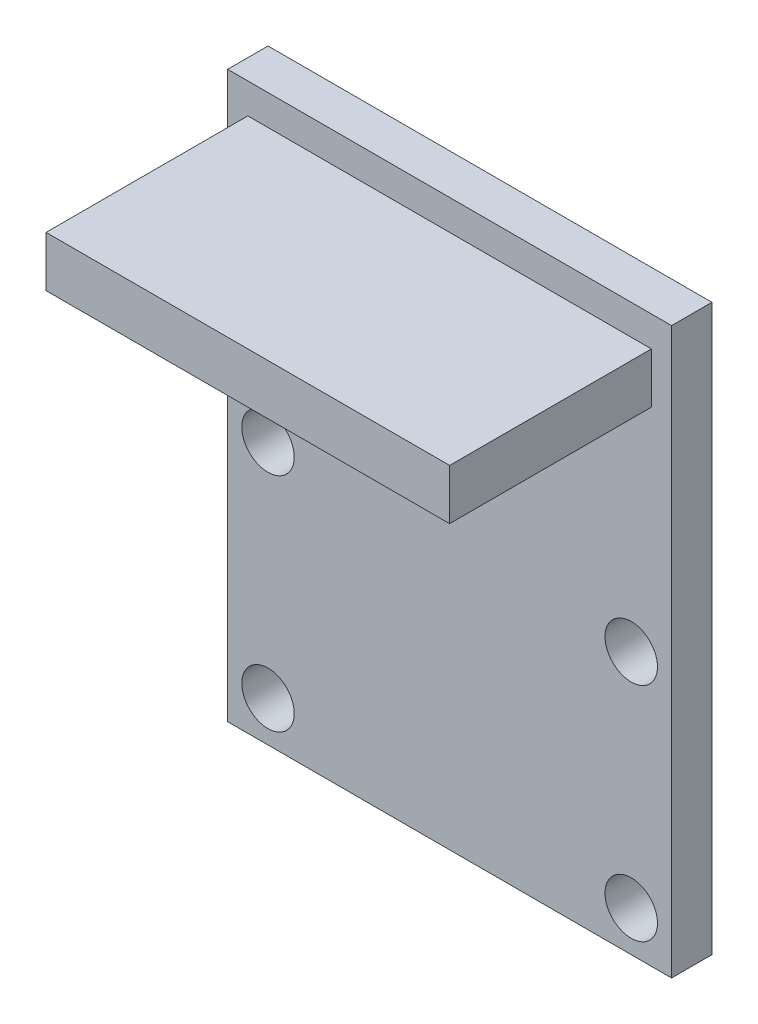
ISO-10303-21;
HEADER;
FILE_DESCRIPTION(('STEP AP214'),'2;1');
FILE_NAME('part.step','',(''),(''),'','','');
FILE_SCHEMA(('AUTOMOTIVE_DESIGN { 1 0 10303 214 1 1 1 1 }'));
ENDSEC;
DATA;
#1=APPLICATION_CONTEXT('core data for automotive mechanical design processes');
#2=APPLICATION_PROTOCOL_DEFINITION('international standard','automotive_design',2000,#1);
#3=PRODUCT_CONTEXT('',#1,'mechanical');
#4=PRODUCT('Part','Part','',(#3));
#5=PRODUCT_RELATED_PRODUCT_CATEGORY('part','',(#4));
#6=PRODUCT_DEFINITION_FORMATION('','',#4);
#7=PRODUCT_DEFINITION_CONTEXT('part definition',#1,'design');
#8=PRODUCT_DEFINITION('design','',#6,#7);
#9=PRODUCT_DEFINITION_SHAPE('','',#8);
#10=(LENGTH_UNIT() NAMED_UNIT(*) SI_UNIT(.MILLI.,.METRE.));
#11=(NAMED_UNIT(*) PLANE_ANGLE_UNIT() SI_UNIT($,.RADIAN.));
#12=(NAMED_UNIT(*) SI_UNIT($,.STERADIAN.) SOLID_ANGLE_UNIT());
#13=UNCERTAINTY_MEASURE_WITH_UNIT(LENGTH_MEASURE(1.E-05),#10,'distance_accuracy_value','');
#14=(GEOMETRIC_REPRESENTATION_CONTEXT(3) GLOBAL_UNCERTAINTY_ASSIGNED_CONTEXT((#13)) GLOBAL_UNIT_ASSIGNED_CONTEXT((#10,
#11,#12)) REPRESENTATION_CONTEXT('',''));
#15=CARTESIAN_POINT('',(0.,0.,0.));
#16=DIRECTION('',(0.,0.,1.));
#17=DIRECTION('',(1.,0.,0.));
#18=AXIS2_PLACEMENT_3D('',#15,#16,#17);
#19=CARTESIAN_POINT('',(0.,0.,2.));
#20=DIRECTION('',(0.,0.,1.));
#21=DIRECTION('',(1.,0.,0.));
#22=AXIS2_PLACEMENT_3D('',#19,#20,#21);
#23=PLANE('',#22);
#24=CARTESIAN_POINT('',(-9.,-0.99794599362229,2.));
#25=DIRECTION('',(0.,0.,1.));
#26=DIRECTION('',(1.,0.,0.));
#27=AXIS2_PLACEMENT_3D('',#24,#25,#26);
#28=CIRCLE('',#27,1.3);
#29=CARTESIAN_POINT('',(-7.7,-0.99794599362229,2.));
#30=VERTEX_POINT('',#29);
#31=EDGE_CURVE('E148',#30,#30,#28,.T.);
#32=ORIENTED_EDGE('',*,*,#31,.F.);
#33=EDGE_LOOP('',(#32));
#34=FACE_BOUND('',#33,.T.);
#35=CARTESIAN_POINT('',(-9.,-11.9979459936223,2.));
#36=DIRECTION('',(0.,0.,1.));
#37=DIRECTION('',(1.,0.,0.));
#38=AXIS2_PLACEMENT_3D('',#35,#36,#37);
#39=CIRCLE('',#38,1.3);
#40=CARTESIAN_POINT('',(-7.7,-11.9979459936223,2.));
#41=VERTEX_POINT('',#40);
#42=EDGE_CURVE('E160',#41,#41,#39,.T.);
#43=ORIENTED_EDGE('',*,*,#42,.F.);
#44=EDGE_LOOP('',(#43));
#45=FACE_BOUND('',#44,.T.);
#46=DIRECTION('',(0.,-1.,0.));
#47=VECTOR('',#46,1.);
#48=CARTESIAN_POINT('',(-11.,14.,2.));
#49=LINE('',#48,#47);
#50=CARTESIAN_POINT('',(-11.,14.,2.));
#51=VERTEX_POINT('',#50);
#52=CARTESIAN_POINT('',(-11.,-14.,2.));
#53=VERTEX_POINT('',#52);
#54=EDGE_CURVE('E166',#51,#53,#49,.T.);
#55=ORIENTED_EDGE('',*,*,#54,.T.);
#56=DIRECTION('',(1.,0.,0.));
#57=VECTOR('',#56,1.);
#58=CARTESIAN_POINT('',(-11.,-14.,2.));
#59=LINE('',#58,#57);
#60=CARTESIAN_POINT('',(11.,-14.,2.));
#61=VERTEX_POINT('',#60);
#62=EDGE_CURVE('E90',#53,#61,#59,.T.);
#63=ORIENTED_EDGE('',*,*,#62,.T.);
#64=DIRECTION('',(0.,1.,0.));
#65=VECTOR('',#64,1.);
#66=CARTESIAN_POINT('',(11.,14.,2.));
#67=LINE('',#66,#65);
#68=CARTESIAN_POINT('',(11.,14.,2.));
#69=VERTEX_POINT('',#68);
#70=EDGE_CURVE('E169',#61,#69,#67,.T.);
#71=ORIENTED_EDGE('',*,*,#70,.T.);
#72=DIRECTION('',(-1.,0.,0.));
#73=VECTOR('',#72,1.);
#74=CARTESIAN_POINT('',(-11.,14.,2.));
#75=LINE('',#74,#73);
#76=EDGE_CURVE('E62',#69,#51,#75,.T.);
#77=ORIENTED_EDGE('',*,*,#76,.T.);
#78=EDGE_LOOP('',(#55,#63,#71,#77));
#79=FACE_BOUND('',#78,.T.);
#80=CARTESIAN_POINT('',(9.,-0.997945993622284,2.));
#81=DIRECTION('',(0.,0.,1.));
#82=DIRECTION('',(1.,0.,0.));
#83=AXIS2_PLACEMENT_3D('',#80,#81,#82);
#84=CIRCLE('',#83,1.3);
#85=CARTESIAN_POINT('',(10.3,-0.997945993622284,2.));
#86=VERTEX_POINT('',#85);
#87=EDGE_CURVE('E154',#86,#86,#84,.T.);
#88=ORIENTED_EDGE('',*,*,#87,.F.);
#89=EDGE_LOOP('',(#88));
#90=FACE_BOUND('',#89,.T.);
#91=CARTESIAN_POINT('',(9.,-11.9979459936223,2.));
#92=DIRECTION('',(0.,0.,1.));
#93=DIRECTION('',(1.,0.,0.));
#94=AXIS2_PLACEMENT_3D('',#91,#92,#93);
#95=CIRCLE('',#94,1.3);
#96=CARTESIAN_POINT('',(10.3,-11.9979459936223,2.));
#97=VERTEX_POINT('',#96);
#98=EDGE_CURVE('E140',#97,#97,#95,.T.);
#99=ORIENTED_EDGE('',*,*,#98,.F.);
#100=EDGE_LOOP('',(#99));
#101=FACE_BOUND('',#100,.T.);
#102=DIRECTION('',(1.,0.,0.));
#103=VECTOR('',#102,1.);
#104=CARTESIAN_POINT('',(-10.,10.,2.));
#105=LINE('',#104,#103);
#106=CARTESIAN_POINT('',(-10.,10.,2.));
#107=VERTEX_POINT('',#106);
#108=CARTESIAN_POINT('',(9.99999999999999,10.,2.));
#109=VERTEX_POINT('',#108);
#110=EDGE_CURVE('E336',#107,#109,#105,.T.);
#111=ORIENTED_EDGE('',*,*,#110,.F.);
#112=DIRECTION('',(0.,-1.,0.));
#113=VECTOR('',#112,1.);
#114=CARTESIAN_POINT('',(-10.,10.,2.));
#115=LINE('',#114,#113);
#116=CARTESIAN_POINT('',(-10.,12.5,2.));
#117=VERTEX_POINT('',#116);
#118=EDGE_CURVE('E135',#117,#107,#115,.T.);
#119=ORIENTED_EDGE('',*,*,#118,.F.);
#120=DIRECTION('',(-1.,0.,0.));
#121=VECTOR('',#120,1.);
#122=CARTESIAN_POINT('',(-10.,12.5,2.));
#123=LINE('',#122,#121);
#124=CARTESIAN_POINT('',(9.99999999999999,12.5,2.));
#125=VERTEX_POINT('',#124);
#126=EDGE_CURVE('E131',#125,#117,#123,.T.);
#127=ORIENTED_EDGE('',*,*,#126,.F.);
#128=DIRECTION('',(0.,1.,0.));
#129=VECTOR('',#128,1.);
#130=CARTESIAN_POINT('',(9.99999999999999,10.,2.));
#131=LINE('',#130,#129);
#132=EDGE_CURVE('E333',#109,#125,#131,.T.);
#133=ORIENTED_EDGE('',*,*,#132,.F.);
#134=EDGE_LOOP('',(#111,#119,#127,#133));
#135=FACE_BOUND('',#134,.T.);
#136=ADVANCED_FACE('F38',(#34,#45,#79,#90,#101,#135),#23,.T.);
#137=CARTESIAN_POINT('',(0.,0.,0.));
#138=DIRECTION('',(0.,0.,1.));
#139=DIRECTION('',(1.,0.,0.));
#140=AXIS2_PLACEMENT_3D('',#137,#138,#139);
#141=PLANE('',#140);
#142=DIRECTION('',(0.,-1.,0.));
#143=VECTOR('',#142,1.);
#144=CARTESIAN_POINT('',(-11.,14.,0.));
#145=LINE('',#144,#143);
#146=CARTESIAN_POINT('',(-11.,14.,0.));
#147=VERTEX_POINT('',#146);
#148=CARTESIAN_POINT('',(-11.,-14.,0.));
#149=VERTEX_POINT('',#148);
#150=EDGE_CURVE('E163',#147,#149,#145,.T.);
#151=ORIENTED_EDGE('',*,*,#150,.F.);
#152=DIRECTION('',(-1.,0.,0.));
#153=VECTOR('',#152,1.);
#154=CARTESIAN_POINT('',(-11.,14.,0.));
#155=LINE('',#154,#153);
#156=CARTESIAN_POINT('',(11.,14.,0.));
#157=VERTEX_POINT('',#156);
#158=EDGE_CURVE('E83',#157,#147,#155,.T.);
#159=ORIENTED_EDGE('',*,*,#158,.F.);
#160=DIRECTION('',(0.,1.,0.));
#161=VECTOR('',#160,1.);
#162=CARTESIAN_POINT('',(11.,14.,0.));
#163=LINE('',#162,#161);
#164=CARTESIAN_POINT('',(11.,-14.,0.));
#165=VERTEX_POINT('',#164);
#166=EDGE_CURVE('E177',#165,#157,#163,.T.);
#167=ORIENTED_EDGE('',*,*,#166,.F.);
#168=DIRECTION('',(1.,0.,0.));
#169=VECTOR('',#168,1.);
#170=CARTESIAN_POINT('',(-11.,-14.,0.));
#171=LINE('',#170,#169);
#172=EDGE_CURVE('E175',#149,#165,#171,.T.);
#173=ORIENTED_EDGE('',*,*,#172,.F.);
#174=EDGE_LOOP('',(#151,#159,#167,#173));
#175=FACE_BOUND('',#174,.T.);
#176=CARTESIAN_POINT('',(-9.,-11.9979459936223,0.));
#177=DIRECTION('',(0.,0.,1.));
#178=DIRECTION('',(1.,0.,0.));
#179=AXIS2_PLACEMENT_3D('',#176,#177,#178);
#180=CIRCLE('',#179,1.3);
#181=CARTESIAN_POINT('',(-7.7,-11.9979459936223,0.));
#182=VERTEX_POINT('',#181);
#183=EDGE_CURVE('E157',#182,#182,#180,.T.);
#184=ORIENTED_EDGE('',*,*,#183,.T.);
#185=EDGE_LOOP('',(#184));
#186=FACE_BOUND('',#185,.T.);
#187=CARTESIAN_POINT('',(9.,-0.997945993622284,0.));
#188=DIRECTION('',(0.,0.,1.));
#189=DIRECTION('',(1.,0.,0.));
#190=AXIS2_PLACEMENT_3D('',#187,#188,#189);
#191=CIRCLE('',#190,1.3);
#192=CARTESIAN_POINT('',(10.3,-0.997945993622284,0.));
#193=VERTEX_POINT('',#192);
#194=EDGE_CURVE('E151',#193,#193,#191,.T.);
#195=ORIENTED_EDGE('',*,*,#194,.T.);
#196=EDGE_LOOP('',(#195));
#197=FACE_BOUND('',#196,.T.);
#198=CARTESIAN_POINT('',(-9.,-0.99794599362229,0.));
#199=DIRECTION('',(0.,0.,1.));
#200=DIRECTION('',(1.,0.,0.));
#201=AXIS2_PLACEMENT_3D('',#198,#199,#200);
#202=CIRCLE('',#201,1.3);
#203=CARTESIAN_POINT('',(-7.7,-0.99794599362229,0.));
#204=VERTEX_POINT('',#203);
#205=EDGE_CURVE('E146',#204,#204,#202,.T.);
#206=ORIENTED_EDGE('',*,*,#205,.T.);
#207=EDGE_LOOP('',(#206));
#208=FACE_BOUND('',#207,.T.);
#209=CARTESIAN_POINT('',(9.,-11.9979459936223,0.));
#210=DIRECTION('',(0.,0.,1.));
#211=DIRECTION('',(1.,0.,0.));
#212=AXIS2_PLACEMENT_3D('',#209,#210,#211);
#213=CIRCLE('',#212,1.3);
#214=CARTESIAN_POINT('',(10.3,-11.9979459936223,0.));
#215=VERTEX_POINT('',#214);
#216=EDGE_CURVE('E137',#215,#215,#213,.T.);
#217=ORIENTED_EDGE('',*,*,#216,.T.);
#218=EDGE_LOOP('',(#217));
#219=FACE_BOUND('',#218,.T.);
#220=ADVANCED_FACE('F190',(#175,#186,#197,#208,#219),#141,.F.);
#221=CARTESIAN_POINT('',(-11.,14.,2.));
#222=DIRECTION('',(1.,0.,0.));
#223=DIRECTION('',(0.,1.,0.));
#224=AXIS2_PLACEMENT_3D('',#221,#222,#223);
#225=PLANE('',#224);
#226=ORIENTED_EDGE('',*,*,#150,.T.);
#227=DIRECTION('',(0.,0.,-1.));
#228=VECTOR('',#227,1.);
#229=CARTESIAN_POINT('',(-11.,-14.,2.));
#230=LINE('',#229,#228);
#231=EDGE_CURVE('E11',#53,#149,#230,.T.);
#232=ORIENTED_EDGE('',*,*,#231,.F.);
#233=ORIENTED_EDGE('',*,*,#54,.F.);
#234=DIRECTION('',(0.,0.,-1.));
#235=VECTOR('',#234,1.);
#236=CARTESIAN_POINT('',(-11.,14.,2.));
#237=LINE('',#236,#235);
#238=EDGE_CURVE('E172',#51,#147,#237,.T.);
#239=ORIENTED_EDGE('',*,*,#238,.T.);
#240=EDGE_LOOP('',(#226,#232,#233,#239));
#241=FACE_BOUND('',#240,.T.);
#242=ADVANCED_FACE('F40',(#241),#225,.F.);
#243=CARTESIAN_POINT('',(-11.,-14.,2.));
#244=DIRECTION('',(0.,1.,0.));
#245=DIRECTION('',(-1.,0.,0.));
#246=AXIS2_PLACEMENT_3D('',#243,#244,#245);
#247=PLANE('',#246);
#248=ORIENTED_EDGE('',*,*,#172,.T.);
#249=DIRECTION('',(0.,0.,-1.));
#250=VECTOR('',#249,1.);
#251=CARTESIAN_POINT('',(11.,-14.,2.));
#252=LINE('',#251,#250);
#253=EDGE_CURVE('E46',#61,#165,#252,.T.);
#254=ORIENTED_EDGE('',*,*,#253,.F.);
#255=ORIENTED_EDGE('',*,*,#62,.F.);
#256=ORIENTED_EDGE('',*,*,#231,.T.);
#257=EDGE_LOOP('',(#248,#254,#255,#256));
#258=FACE_BOUND('',#257,.T.);
#259=ADVANCED_FACE('F206',(#258),#247,.F.);
#260=CARTESIAN_POINT('',(11.,14.,2.));
#261=DIRECTION('',(-1.,0.,0.));
#262=DIRECTION('',(0.,-1.,0.));
#263=AXIS2_PLACEMENT_3D('',#260,#261,#262);
#264=PLANE('',#263);
#265=ORIENTED_EDGE('',*,*,#166,.T.);
#266=DIRECTION('',(0.,0.,-1.));
#267=VECTOR('',#266,1.);
#268=CARTESIAN_POINT('',(11.,14.,2.));
#269=LINE('',#268,#267);
#270=EDGE_CURVE('E181',#69,#157,#269,.T.);
#271=ORIENTED_EDGE('',*,*,#270,.F.);
#272=ORIENTED_EDGE('',*,*,#70,.F.);
#273=ORIENTED_EDGE('',*,*,#253,.T.);
#274=EDGE_LOOP('',(#265,#271,#272,#273));
#275=FACE_BOUND('',#274,.T.);
#276=ADVANCED_FACE('F186',(#275),#264,.F.);
#277=CARTESIAN_POINT('',(-11.,14.,2.));
#278=DIRECTION('',(0.,-1.,0.));
#279=DIRECTION('',(1.,0.,0.));
#280=AXIS2_PLACEMENT_3D('',#277,#278,#279);
#281=PLANE('',#280);
#282=ORIENTED_EDGE('',*,*,#158,.T.);
#283=ORIENTED_EDGE('',*,*,#238,.F.);
#284=ORIENTED_EDGE('',*,*,#76,.F.);
#285=ORIENTED_EDGE('',*,*,#270,.T.);
#286=EDGE_LOOP('',(#282,#283,#284,#285));
#287=FACE_BOUND('',#286,.T.);
#288=ADVANCED_FACE('F195',(#287),#281,.F.);
#289=CARTESIAN_POINT('',(-9.,-11.9979459936223,2.));
#290=DIRECTION('',(0.,0.,-1.));
#291=DIRECTION('',(-1.,0.,0.));
#292=AXIS2_PLACEMENT_3D('',#289,#290,#291);
#293=CYLINDRICAL_SURFACE('',#292,1.3);
#294=ORIENTED_EDGE('',*,*,#42,.T.);
#295=EDGE_LOOP('',(#294));
#296=FACE_BOUND('',#295,.T.);
#297=ORIENTED_EDGE('',*,*,#183,.F.);
#298=EDGE_LOOP('',(#297));
#299=FACE_BOUND('',#298,.T.);
#300=ADVANCED_FACE('F197',(#296,#299),#293,.F.);
#301=CARTESIAN_POINT('',(9.,-0.997945993622284,2.));
#302=DIRECTION('',(0.,0.,-1.));
#303=DIRECTION('',(-1.,0.,0.));
#304=AXIS2_PLACEMENT_3D('',#301,#302,#303);
#305=CYLINDRICAL_SURFACE('',#304,1.3);
#306=ORIENTED_EDGE('',*,*,#87,.T.);
#307=EDGE_LOOP('',(#306));
#308=FACE_BOUND('',#307,.T.);
#309=ORIENTED_EDGE('',*,*,#194,.F.);
#310=EDGE_LOOP('',(#309));
#311=FACE_BOUND('',#310,.T.);
#312=ADVANCED_FACE('F203',(#308,#311),#305,.F.);
#313=CARTESIAN_POINT('',(-9.,-0.99794599362229,2.));
#314=DIRECTION('',(0.,0.,-1.));
#315=DIRECTION('',(-1.,0.,0.));
#316=AXIS2_PLACEMENT_3D('',#313,#314,#315);
#317=CYLINDRICAL_SURFACE('',#316,1.3);
#318=ORIENTED_EDGE('',*,*,#31,.T.);
#319=EDGE_LOOP('',(#318));
#320=FACE_BOUND('',#319,.T.);
#321=ORIENTED_EDGE('',*,*,#205,.F.);
#322=EDGE_LOOP('',(#321));
#323=FACE_BOUND('',#322,.T.);
#324=ADVANCED_FACE('F220',(#320,#323),#317,.F.);
#325=CARTESIAN_POINT('',(9.,-11.9979459936223,2.));
#326=DIRECTION('',(0.,0.,-1.));
#327=DIRECTION('',(-1.,0.,0.));
#328=AXIS2_PLACEMENT_3D('',#325,#326,#327);
#329=CYLINDRICAL_SURFACE('',#328,1.3);
#330=ORIENTED_EDGE('',*,*,#98,.T.);
#331=EDGE_LOOP('',(#330));
#332=FACE_BOUND('',#331,.T.);
#333=ORIENTED_EDGE('',*,*,#216,.F.);
#334=EDGE_LOOP('',(#333));
#335=FACE_BOUND('',#334,.T.);
#336=ADVANCED_FACE('F224',(#332,#335),#329,.F.);
#337=CARTESIAN_POINT('',(-10.,10.,12.));
#338=DIRECTION('',(1.,0.,0.));
#339=DIRECTION('',(0.,0.,-1.));
#340=AXIS2_PLACEMENT_3D('',#337,#338,#339);
#341=PLANE('',#340);
#342=ORIENTED_EDGE('',*,*,#118,.T.);
#343=DIRECTION('',(0.,0.,-1.));
#344=VECTOR('',#343,1.);
#345=CARTESIAN_POINT('',(-10.,10.,12.));
#346=LINE('',#345,#344);
#347=CARTESIAN_POINT('',(-10.,10.,12.));
#348=VERTEX_POINT('',#347);
#349=EDGE_CURVE('E116',#348,#107,#346,.T.);
#350=ORIENTED_EDGE('',*,*,#349,.F.);
#351=DIRECTION('',(0.,-1.,0.));
#352=VECTOR('',#351,1.);
#353=CARTESIAN_POINT('',(-10.,10.,12.));
#354=LINE('',#353,#352);
#355=CARTESIAN_POINT('',(-10.,12.5,12.));
#356=VERTEX_POINT('',#355);
#357=EDGE_CURVE('E123',#356,#348,#354,.T.);
#358=ORIENTED_EDGE('',*,*,#357,.F.);
#359=DIRECTION('',(0.,0.,-1.));
#360=VECTOR('',#359,1.);
#361=CARTESIAN_POINT('',(-10.,12.5,12.));
#362=LINE('',#361,#360);
#363=EDGE_CURVE('E330',#356,#117,#362,.T.);
#364=ORIENTED_EDGE('',*,*,#363,.T.);
#365=EDGE_LOOP('',(#342,#350,#358,#364));
#366=FACE_BOUND('',#365,.T.);
#367=ADVANCED_FACE('F133',(#366),#341,.F.);
#368=CARTESIAN_POINT('',(-10.,10.,12.));
#369=DIRECTION('',(0.,1.,0.));
#370=DIRECTION('',(-1.,0.,0.));
#371=AXIS2_PLACEMENT_3D('',#368,#369,#370);
#372=PLANE('',#371);
#373=ORIENTED_EDGE('',*,*,#110,.T.);
#374=DIRECTION('',(0.,0.,-1.));
#375=VECTOR('',#374,1.);
#376=CARTESIAN_POINT('',(9.99999999999999,10.,12.));
#377=LINE('',#376,#375);
#378=CARTESIAN_POINT('',(9.99999999999999,10.,12.));
#379=VERTEX_POINT('',#378);
#380=EDGE_CURVE('E119',#379,#109,#377,.T.);
#381=ORIENTED_EDGE('',*,*,#380,.F.);
#382=DIRECTION('',(1.,0.,0.));
#383=VECTOR('',#382,1.);
#384=CARTESIAN_POINT('',(-10.,10.,12.));
#385=LINE('',#384,#383);
#386=EDGE_CURVE('E112',#348,#379,#385,.T.);
#387=ORIENTED_EDGE('',*,*,#386,.F.);
#388=ORIENTED_EDGE('',*,*,#349,.T.);
#389=EDGE_LOOP('',(#373,#381,#387,#388));
#390=FACE_BOUND('',#389,.T.);
#391=ADVANCED_FACE('F114',(#390),#372,.F.);
#392=CARTESIAN_POINT('',(9.99999999999999,10.,12.));
#393=DIRECTION('',(-1.,0.,0.));
#394=DIRECTION('',(0.,0.,1.));
#395=AXIS2_PLACEMENT_3D('',#392,#393,#394);
#396=PLANE('',#395);
#397=ORIENTED_EDGE('',*,*,#132,.T.);
#398=DIRECTION('',(0.,0.,-1.));
#399=VECTOR('',#398,1.);
#400=CARTESIAN_POINT('',(9.99999999999999,12.5,12.));
#401=LINE('',#400,#399);
#402=CARTESIAN_POINT('',(9.99999999999999,12.5,12.));
#403=VERTEX_POINT('',#402);
#404=EDGE_CURVE('E53',#403,#125,#401,.T.);
#405=ORIENTED_EDGE('',*,*,#404,.F.);
#406=DIRECTION('',(0.,1.,0.));
#407=VECTOR('',#406,1.);
#408=CARTESIAN_POINT('',(9.99999999999999,10.,12.));
#409=LINE('',#408,#407);
#410=EDGE_CURVE('E122',#379,#403,#409,.T.);
#411=ORIENTED_EDGE('',*,*,#410,.F.);
#412=ORIENTED_EDGE('',*,*,#380,.T.);
#413=EDGE_LOOP('',(#397,#405,#411,#412));
#414=FACE_BOUND('',#413,.T.);
#415=ADVANCED_FACE('F233',(#414),#396,.F.);
#416=CARTESIAN_POINT('',(-10.,12.5,12.));
#417=DIRECTION('',(0.,-1.,0.));
#418=DIRECTION('',(1.,0.,0.));
#419=AXIS2_PLACEMENT_3D('',#416,#417,#418);
#420=PLANE('',#419);
#421=ORIENTED_EDGE('',*,*,#126,.T.);
#422=ORIENTED_EDGE('',*,*,#363,.F.);
#423=DIRECTION('',(-1.,0.,0.));
#424=VECTOR('',#423,1.);
#425=CARTESIAN_POINT('',(-10.,12.5,12.));
#426=LINE('',#425,#424);
#427=EDGE_CURVE('E127',#403,#356,#426,.T.);
#428=ORIENTED_EDGE('',*,*,#427,.F.);
#429=ORIENTED_EDGE('',*,*,#404,.T.);
#430=EDGE_LOOP('',(#421,#422,#428,#429));
#431=FACE_BOUND('',#430,.T.);
#432=ADVANCED_FACE('F236',(#431),#420,.F.);
#433=CARTESIAN_POINT('',(0.,0.,12.));
#434=DIRECTION('',(0.,0.,-1.));
#435=DIRECTION('',(-1.,0.,0.));
#436=AXIS2_PLACEMENT_3D('',#433,#434,#435);
#437=PLANE('',#436);
#438=ORIENTED_EDGE('',*,*,#357,.T.);
#439=ORIENTED_EDGE('',*,*,#386,.T.);
#440=ORIENTED_EDGE('',*,*,#410,.T.);
#441=ORIENTED_EDGE('',*,*,#427,.T.);
#442=EDGE_LOOP('',(#438,#439,#440,#441));
#443=FACE_BOUND('',#442,.T.);
#444=ADVANCED_FACE('F126',(#443),#437,.F.);
#445=CLOSED_SHELL('',(#136,#220,#242,#259,#276,#288,#300,#312,#324,#336,#367,#391,#415,#432,#444));
#446=MANIFOLD_SOLID_BREP('B2',#445);
#447=ADVANCED_BREP_SHAPE_REPRESENTATION('',(#18,#446),#14);
#448=SHAPE_DEFINITION_REPRESENTATION(#9,#447);
ENDSEC;
END-ISO-10303-21;
